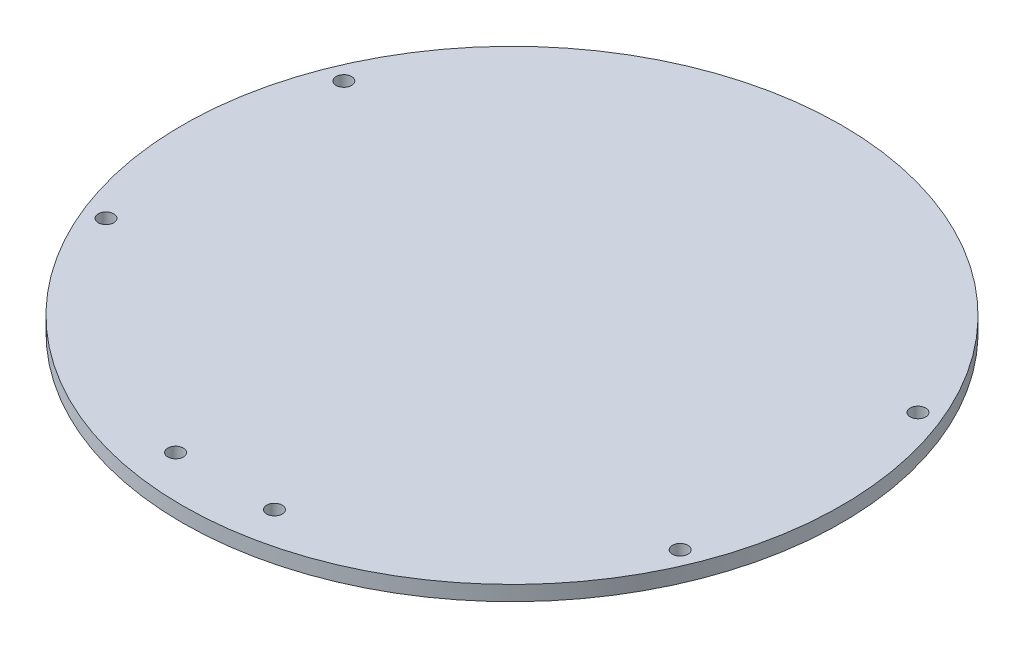
ISO-10303-21;
HEADER;
FILE_DESCRIPTION(('STEP AP214'),'2;1');
FILE_NAME('part.step','',(''),(''),'','','');
FILE_SCHEMA(('AUTOMOTIVE_DESIGN { 1 0 10303 214 1 1 1 1 }'));
ENDSEC;
DATA;
#1=APPLICATION_CONTEXT('core data for automotive mechanical design processes');
#2=APPLICATION_PROTOCOL_DEFINITION('international standard','automotive_design',2000,#1);
#3=PRODUCT_CONTEXT('',#1,'mechanical');
#4=PRODUCT('Part','Part','',(#3));
#5=PRODUCT_RELATED_PRODUCT_CATEGORY('part','',(#4));
#6=PRODUCT_DEFINITION_FORMATION('','',#4);
#7=PRODUCT_DEFINITION_CONTEXT('part definition',#1,'design');
#8=PRODUCT_DEFINITION('design','',#6,#7);
#9=PRODUCT_DEFINITION_SHAPE('','',#8);
#10=(LENGTH_UNIT() NAMED_UNIT(*) SI_UNIT(.MILLI.,.METRE.));
#11=(NAMED_UNIT(*) PLANE_ANGLE_UNIT() SI_UNIT($,.RADIAN.));
#12=(NAMED_UNIT(*) SI_UNIT($,.STERADIAN.) SOLID_ANGLE_UNIT());
#13=UNCERTAINTY_MEASURE_WITH_UNIT(LENGTH_MEASURE(1.E-05),#10,'distance_accuracy_value','');
#14=(GEOMETRIC_REPRESENTATION_CONTEXT(3) GLOBAL_UNCERTAINTY_ASSIGNED_CONTEXT((#13)) GLOBAL_UNIT_ASSIGNED_CONTEXT((#10,
#11,#12)) REPRESENTATION_CONTEXT('',''));
#15=CARTESIAN_POINT('',(0.,0.,0.));
#16=DIRECTION('',(0.,0.,1.));
#17=DIRECTION('',(1.,0.,0.));
#18=AXIS2_PLACEMENT_3D('',#15,#16,#17);
#19=CARTESIAN_POINT('',(0.,3.175,0.));
#20=DIRECTION('',(0.,-1.,0.));
#21=DIRECTION('',(0.,0.,-1.));
#22=AXIS2_PLACEMENT_3D('',#19,#20,#21);
#23=CYLINDRICAL_SURFACE('',#22,70.);
#24=CARTESIAN_POINT('',(0.,3.175,0.));
#25=DIRECTION('',(0.,1.,0.));
#26=DIRECTION('',(0.,0.,1.));
#27=AXIS2_PLACEMENT_3D('',#24,#25,#26);
#28=CIRCLE('',#27,70.);
#29=CARTESIAN_POINT('',(0.,3.175,70.));
#30=VERTEX_POINT('',#29);
#31=EDGE_CURVE('E11',#30,#30,#28,.T.);
#32=ORIENTED_EDGE('',*,*,#31,.F.);
#33=EDGE_LOOP('',(#32));
#34=FACE_BOUND('',#33,.T.);
#35=CARTESIAN_POINT('',(0.,0.,0.));
#36=DIRECTION('',(0.,1.,0.));
#37=DIRECTION('',(0.,0.,1.));
#38=AXIS2_PLACEMENT_3D('',#35,#36,#37);
#39=CIRCLE('',#38,70.);
#40=CARTESIAN_POINT('',(0.,0.,70.));
#41=VERTEX_POINT('',#40);
#42=EDGE_CURVE('E36',#41,#41,#39,.T.);
#43=ORIENTED_EDGE('',*,*,#42,.T.);
#44=EDGE_LOOP('',(#43));
#45=FACE_BOUND('',#44,.T.);
#46=ADVANCED_FACE('F33',(#34,#45),#23,.T.);
#47=CARTESIAN_POINT('',(0.,3.175,0.));
#48=DIRECTION('',(0.,1.,0.));
#49=DIRECTION('',(0.,0.,1.));
#50=AXIS2_PLACEMENT_3D('',#47,#48,#49);
#51=PLANE('',#50);
#52=CARTESIAN_POINT('',(-60.9760491457449,3.175,25.257106536096));
#53=DIRECTION('',(0.,1.,0.));
#54=DIRECTION('',(0.,0.,1.));
#55=AXIS2_PLACEMENT_3D('',#52,#53,#54);
#56=CIRCLE('',#55,1.65);
#57=CARTESIAN_POINT('',(-60.9760491457449,3.175,26.907106536096));
#58=VERTEX_POINT('',#57);
#59=EDGE_CURVE('E85',#58,#58,#56,.T.);
#60=ORIENTED_EDGE('',*,*,#59,.F.);
#61=EDGE_LOOP('',(#60));
#62=FACE_BOUND('',#61,.T.);
#63=CARTESIAN_POINT('',(60.9760491457449,3.175,25.257106536096));
#64=DIRECTION('',(0.,1.,0.));
#65=DIRECTION('',(0.,0.,-1.));
#66=AXIS2_PLACEMENT_3D('',#63,#64,#65);
#67=CIRCLE('',#66,1.65);
#68=CARTESIAN_POINT('',(60.9760491457449,3.175,23.607106536096));
#69=VERTEX_POINT('',#68);
#70=EDGE_CURVE('E67',#69,#69,#67,.T.);
#71=ORIENTED_EDGE('',*,*,#70,.F.);
#72=EDGE_LOOP('',(#71));
#73=FACE_BOUND('',#72,.T.);
#74=CARTESIAN_POINT('',(-10.5,3.175,60.9530592885999));
#75=DIRECTION('',(0.,1.,0.));
#76=DIRECTION('',(0.,0.,1.));
#77=AXIS2_PLACEMENT_3D('',#74,#75,#76);
#78=CIRCLE('',#77,1.65);
#79=CARTESIAN_POINT('',(-10.5,3.175,62.6030592886));
#80=VERTEX_POINT('',#79);
#81=EDGE_CURVE('E75',#80,#80,#78,.T.);
#82=ORIENTED_EDGE('',*,*,#81,.F.);
#83=EDGE_LOOP('',(#82));
#84=FACE_BOUND('',#83,.T.);
#85=CARTESIAN_POINT('',(60.9760491457449,3.175,-25.257106536096));
#86=DIRECTION('',(0.,1.,0.));
#87=DIRECTION('',(0.,0.,1.));
#88=AXIS2_PLACEMENT_3D('',#85,#86,#87);
#89=CIRCLE('',#88,1.65);
#90=CARTESIAN_POINT('',(60.9760491457449,3.175,-23.607106536096));
#91=VERTEX_POINT('',#90);
#92=EDGE_CURVE('E48',#91,#91,#89,.T.);
#93=ORIENTED_EDGE('',*,*,#92,.F.);
#94=EDGE_LOOP('',(#93));
#95=FACE_BOUND('',#94,.T.);
#96=CARTESIAN_POINT('',(-60.9760491457449,3.175,-25.257106536096));
#97=DIRECTION('',(0.,1.,0.));
#98=DIRECTION('',(0.,0.,-1.));
#99=AXIS2_PLACEMENT_3D('',#96,#97,#98);
#100=CIRCLE('',#99,1.65);
#101=CARTESIAN_POINT('',(-60.9760491457449,3.175,-26.907106536096));
#102=VERTEX_POINT('',#101);
#103=EDGE_CURVE('E59',#102,#102,#100,.T.);
#104=ORIENTED_EDGE('',*,*,#103,.F.);
#105=EDGE_LOOP('',(#104));
#106=FACE_BOUND('',#105,.T.);
#107=CARTESIAN_POINT('',(10.5,3.175,60.9530592885999));
#108=DIRECTION('',(0.,1.,0.));
#109=DIRECTION('',(0.,0.,1.));
#110=AXIS2_PLACEMENT_3D('',#107,#108,#109);
#111=CIRCLE('',#110,1.65);
#112=CARTESIAN_POINT('',(10.5,3.175,62.6030592886));
#113=VERTEX_POINT('',#112);
#114=EDGE_CURVE('E42',#113,#113,#111,.T.);
#115=ORIENTED_EDGE('',*,*,#114,.F.);
#116=EDGE_LOOP('',(#115));
#117=FACE_BOUND('',#116,.T.);
#118=ORIENTED_EDGE('',*,*,#31,.T.);
#119=EDGE_LOOP('',(#118));
#120=FACE_BOUND('',#119,.T.);
#121=ADVANCED_FACE('F112',(#62,#73,#84,#95,#106,#117,#120),#51,.T.);
#122=CARTESIAN_POINT('',(0.,0.,0.));
#123=DIRECTION('',(0.,1.,0.));
#124=DIRECTION('',(0.,0.,1.));
#125=AXIS2_PLACEMENT_3D('',#122,#123,#124);
#126=PLANE('',#125);
#127=CARTESIAN_POINT('',(-60.9760491457449,0.,25.257106536096));
#128=DIRECTION('',(0.,1.,0.));
#129=DIRECTION('',(0.,0.,1.));
#130=AXIS2_PLACEMENT_3D('',#127,#128,#129);
#131=CIRCLE('',#130,1.65);
#132=CARTESIAN_POINT('',(-60.9760491457449,0.,26.907106536096));
#133=VERTEX_POINT('',#132);
#134=EDGE_CURVE('E63',#133,#133,#131,.T.);
#135=ORIENTED_EDGE('',*,*,#134,.T.);
#136=EDGE_LOOP('',(#135));
#137=FACE_BOUND('',#136,.T.);
#138=CARTESIAN_POINT('',(60.9760491457449,0.,25.257106536096));
#139=DIRECTION('',(0.,1.,0.));
#140=DIRECTION('',(0.,0.,-1.));
#141=AXIS2_PLACEMENT_3D('',#138,#139,#140);
#142=CIRCLE('',#141,1.65);
#143=CARTESIAN_POINT('',(60.9760491457449,0.,23.607106536096));
#144=VERTEX_POINT('',#143);
#145=EDGE_CURVE('E71',#144,#144,#142,.T.);
#146=ORIENTED_EDGE('',*,*,#145,.T.);
#147=EDGE_LOOP('',(#146));
#148=FACE_BOUND('',#147,.T.);
#149=CARTESIAN_POINT('',(-10.5,0.,60.9530592885999));
#150=DIRECTION('',(0.,1.,0.));
#151=DIRECTION('',(0.,0.,1.));
#152=AXIS2_PLACEMENT_3D('',#149,#150,#151);
#153=CIRCLE('',#152,1.65);
#154=CARTESIAN_POINT('',(-10.5,0.,62.6030592886));
#155=VERTEX_POINT('',#154);
#156=EDGE_CURVE('E52',#155,#155,#153,.T.);
#157=ORIENTED_EDGE('',*,*,#156,.T.);
#158=EDGE_LOOP('',(#157));
#159=FACE_BOUND('',#158,.T.);
#160=CARTESIAN_POINT('',(60.9760491457449,0.,-25.257106536096));
#161=DIRECTION('',(0.,1.,0.));
#162=DIRECTION('',(0.,0.,1.));
#163=AXIS2_PLACEMENT_3D('',#160,#161,#162);
#164=CIRCLE('',#163,1.65);
#165=CARTESIAN_POINT('',(60.9760491457449,0.,-23.607106536096));
#166=VERTEX_POINT('',#165);
#167=EDGE_CURVE('E79',#166,#166,#164,.T.);
#168=ORIENTED_EDGE('',*,*,#167,.T.);
#169=EDGE_LOOP('',(#168));
#170=FACE_BOUND('',#169,.T.);
#171=CARTESIAN_POINT('',(-60.9760491457449,0.,-25.257106536096));
#172=DIRECTION('',(0.,1.,0.));
#173=DIRECTION('',(0.,0.,-1.));
#174=AXIS2_PLACEMENT_3D('',#171,#172,#173);
#175=CIRCLE('',#174,1.65);
#176=CARTESIAN_POINT('',(-60.9760491457449,0.,-26.907106536096));
#177=VERTEX_POINT('',#176);
#178=EDGE_CURVE('E64',#177,#177,#175,.T.);
#179=ORIENTED_EDGE('',*,*,#178,.T.);
#180=EDGE_LOOP('',(#179));
#181=FACE_BOUND('',#180,.T.);
#182=CARTESIAN_POINT('',(10.5,0.,60.9530592885999));
#183=DIRECTION('',(0.,1.,0.));
#184=DIRECTION('',(0.,0.,1.));
#185=AXIS2_PLACEMENT_3D('',#182,#183,#184);
#186=CIRCLE('',#185,1.65);
#187=CARTESIAN_POINT('',(10.5,0.,62.6030592886));
#188=VERTEX_POINT('',#187);
#189=EDGE_CURVE('E45',#188,#188,#186,.T.);
#190=ORIENTED_EDGE('',*,*,#189,.T.);
#191=EDGE_LOOP('',(#190));
#192=FACE_BOUND('',#191,.T.);
#193=ORIENTED_EDGE('',*,*,#42,.F.);
#194=EDGE_LOOP('',(#193));
#195=FACE_BOUND('',#194,.T.);
#196=ADVANCED_FACE('F93',(#137,#148,#159,#170,#181,#192,#195),#126,.F.);
#197=CARTESIAN_POINT('',(10.5,3.175,60.9530592885999));
#198=DIRECTION('',(0.,-1.,0.));
#199=DIRECTION('',(0.,0.,-1.));
#200=AXIS2_PLACEMENT_3D('',#197,#198,#199);
#201=CYLINDRICAL_SURFACE('',#200,1.65);
#202=ORIENTED_EDGE('',*,*,#114,.T.);
#203=EDGE_LOOP('',(#202));
#204=FACE_BOUND('',#203,.T.);
#205=ORIENTED_EDGE('',*,*,#189,.F.);
#206=EDGE_LOOP('',(#205));
#207=FACE_BOUND('',#206,.T.);
#208=ADVANCED_FACE('F123',(#204,#207),#201,.F.);
#209=CARTESIAN_POINT('',(-60.9760491457449,3.175,-25.257106536096));
#210=DIRECTION('',(0.,-1.,0.));
#211=DIRECTION('',(0.,0.,-1.));
#212=AXIS2_PLACEMENT_3D('',#209,#210,#211);
#213=CYLINDRICAL_SURFACE('',#212,1.65);
#214=ORIENTED_EDGE('',*,*,#103,.T.);
#215=EDGE_LOOP('',(#214));
#216=FACE_BOUND('',#215,.T.);
#217=ORIENTED_EDGE('',*,*,#178,.F.);
#218=EDGE_LOOP('',(#217));
#219=FACE_BOUND('',#218,.T.);
#220=ADVANCED_FACE('F128',(#216,#219),#213,.F.);
#221=CARTESIAN_POINT('',(60.9760491457449,3.175,-25.257106536096));
#222=DIRECTION('',(0.,-1.,0.));
#223=DIRECTION('',(0.,0.,-1.));
#224=AXIS2_PLACEMENT_3D('',#221,#222,#223);
#225=CYLINDRICAL_SURFACE('',#224,1.65);
#226=ORIENTED_EDGE('',*,*,#92,.T.);
#227=EDGE_LOOP('',(#226));
#228=FACE_BOUND('',#227,.T.);
#229=ORIENTED_EDGE('',*,*,#167,.F.);
#230=EDGE_LOOP('',(#229));
#231=FACE_BOUND('',#230,.T.);
#232=ADVANCED_FACE('F107',(#228,#231),#225,.F.);
#233=CARTESIAN_POINT('',(-10.5,3.175,60.9530592885999));
#234=DIRECTION('',(0.,-1.,0.));
#235=DIRECTION('',(0.,0.,-1.));
#236=AXIS2_PLACEMENT_3D('',#233,#234,#235);
#237=CYLINDRICAL_SURFACE('',#236,1.65);
#238=ORIENTED_EDGE('',*,*,#81,.T.);
#239=EDGE_LOOP('',(#238));
#240=FACE_BOUND('',#239,.T.);
#241=ORIENTED_EDGE('',*,*,#156,.F.);
#242=EDGE_LOOP('',(#241));
#243=FACE_BOUND('',#242,.T.);
#244=ADVANCED_FACE('F99',(#240,#243),#237,.F.);
#245=CARTESIAN_POINT('',(60.9760491457449,3.175,25.257106536096));
#246=DIRECTION('',(0.,-1.,0.));
#247=DIRECTION('',(0.,0.,-1.));
#248=AXIS2_PLACEMENT_3D('',#245,#246,#247);
#249=CYLINDRICAL_SURFACE('',#248,1.65);
#250=ORIENTED_EDGE('',*,*,#70,.T.);
#251=EDGE_LOOP('',(#250));
#252=FACE_BOUND('',#251,.T.);
#253=ORIENTED_EDGE('',*,*,#145,.F.);
#254=EDGE_LOOP('',(#253));
#255=FACE_BOUND('',#254,.T.);
#256=ADVANCED_FACE('F96',(#252,#255),#249,.F.);
#257=CARTESIAN_POINT('',(-60.9760491457449,3.175,25.257106536096));
#258=DIRECTION('',(0.,-1.,0.));
#259=DIRECTION('',(0.,0.,-1.));
#260=AXIS2_PLACEMENT_3D('',#257,#258,#259);
#261=CYLINDRICAL_SURFACE('',#260,1.65);
#262=ORIENTED_EDGE('',*,*,#59,.T.);
#263=EDGE_LOOP('',(#262));
#264=FACE_BOUND('',#263,.T.);
#265=ORIENTED_EDGE('',*,*,#134,.F.);
#266=EDGE_LOOP('',(#265));
#267=FACE_BOUND('',#266,.T.);
#268=ADVANCED_FACE('F98',(#264,#267),#261,.F.);
#269=CLOSED_SHELL('',(#46,#121,#196,#208,#220,#232,#244,#256,#268));
#270=MANIFOLD_SOLID_BREP('B2',#269);
#271=ADVANCED_BREP_SHAPE_REPRESENTATION('',(#18,#270),#14);
#272=SHAPE_DEFINITION_REPRESENTATION(#9,#271);
ENDSEC;
END-ISO-10303-21;
